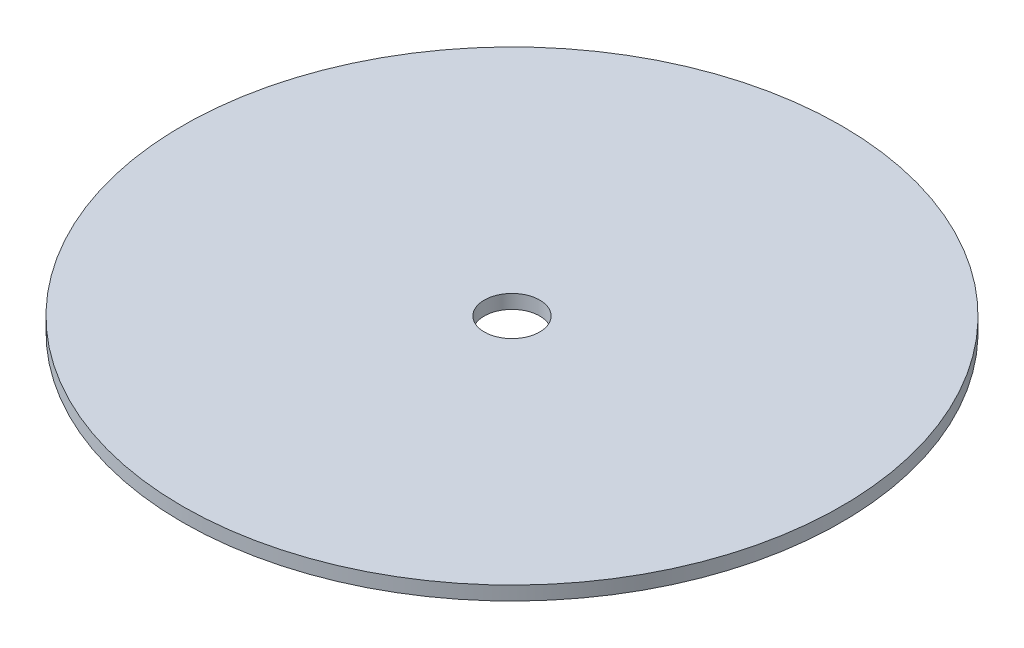
ISO-10303-21;
HEADER;
FILE_DESCRIPTION(('STEP AP214'),'2;1');
FILE_NAME('part.step','',(''),(''),'','','');
FILE_SCHEMA(('AUTOMOTIVE_DESIGN { 1 0 10303 214 1 1 1 1 }'));
ENDSEC;
DATA;
#1=APPLICATION_CONTEXT('core data for automotive mechanical design processes');
#2=APPLICATION_PROTOCOL_DEFINITION('international standard','automotive_design',2000,#1);
#3=PRODUCT_CONTEXT('',#1,'mechanical');
#4=PRODUCT('Part','Part','',(#3));
#5=PRODUCT_RELATED_PRODUCT_CATEGORY('part','',(#4));
#6=PRODUCT_DEFINITION_FORMATION('','',#4);
#7=PRODUCT_DEFINITION_CONTEXT('part definition',#1,'design');
#8=PRODUCT_DEFINITION('design','',#6,#7);
#9=PRODUCT_DEFINITION_SHAPE('','',#8);
#10=(LENGTH_UNIT() NAMED_UNIT(*) SI_UNIT(.MILLI.,.METRE.));
#11=(NAMED_UNIT(*) PLANE_ANGLE_UNIT() SI_UNIT($,.RADIAN.));
#12=(NAMED_UNIT(*) SI_UNIT($,.STERADIAN.) SOLID_ANGLE_UNIT());
#13=UNCERTAINTY_MEASURE_WITH_UNIT(LENGTH_MEASURE(1.E-05),#10,'distance_accuracy_value','');
#14=(GEOMETRIC_REPRESENTATION_CONTEXT(3) GLOBAL_UNCERTAINTY_ASSIGNED_CONTEXT((#13)) GLOBAL_UNIT_ASSIGNED_CONTEXT((#10,
#11,#12)) REPRESENTATION_CONTEXT('',''));
#15=CARTESIAN_POINT('',(0.,0.,0.));
#16=DIRECTION('',(0.,0.,1.));
#17=DIRECTION('',(1.,0.,0.));
#18=AXIS2_PLACEMENT_3D('',#15,#16,#17);
#19=CARTESIAN_POINT('',(0.,3.175,0.));
#20=DIRECTION('',(0.,-1.,0.));
#21=DIRECTION('',(0.,0.,-1.));
#22=AXIS2_PLACEMENT_3D('',#19,#20,#21);
#23=CYLINDRICAL_SURFACE('',#22,75.565);
#24=CARTESIAN_POINT('',(0.,3.175,0.));
#25=DIRECTION('',(0.,1.,0.));
#26=DIRECTION('',(0.,0.,1.));
#27=AXIS2_PLACEMENT_3D('',#24,#25,#26);
#28=CIRCLE('',#27,75.565);
#29=CARTESIAN_POINT('',(0.,3.175,75.565));
#30=VERTEX_POINT('',#29);
#31=EDGE_CURVE('E10',#30,#30,#28,.T.);
#32=ORIENTED_EDGE('',*,*,#31,.F.);
#33=EDGE_LOOP('',(#32));
#34=FACE_BOUND('',#33,.T.);
#35=CARTESIAN_POINT('',(0.,0.,0.));
#36=DIRECTION('',(0.,1.,0.));
#37=DIRECTION('',(0.,0.,1.));
#38=AXIS2_PLACEMENT_3D('',#35,#36,#37);
#39=CIRCLE('',#38,75.565);
#40=CARTESIAN_POINT('',(0.,0.,75.565));
#41=VERTEX_POINT('',#40);
#42=EDGE_CURVE('E34',#41,#41,#39,.T.);
#43=ORIENTED_EDGE('',*,*,#42,.T.);
#44=EDGE_LOOP('',(#43));
#45=FACE_BOUND('',#44,.T.);
#46=ADVANCED_FACE('F31',(#34,#45),#23,.T.);
#47=CARTESIAN_POINT('',(0.,3.175,0.));
#48=DIRECTION('',(0.,1.,0.));
#49=DIRECTION('',(0.,0.,1.));
#50=AXIS2_PLACEMENT_3D('',#47,#48,#49);
#51=PLANE('',#50);
#52=CARTESIAN_POINT('',(0.,3.175,0.));
#53=DIRECTION('',(0.,1.,0.));
#54=DIRECTION('',(0.,0.,1.));
#55=AXIS2_PLACEMENT_3D('',#52,#53,#54);
#56=CIRCLE('',#55,6.35);
#57=CARTESIAN_POINT('',(0.,3.175,6.35));
#58=VERTEX_POINT('',#57);
#59=EDGE_CURVE('E41',#58,#58,#56,.T.);
#60=ORIENTED_EDGE('',*,*,#59,.F.);
#61=EDGE_LOOP('',(#60));
#62=FACE_BOUND('',#61,.T.);
#63=ORIENTED_EDGE('',*,*,#31,.T.);
#64=EDGE_LOOP('',(#63));
#65=FACE_BOUND('',#64,.T.);
#66=ADVANCED_FACE('F59',(#62,#65),#51,.T.);
#67=CARTESIAN_POINT('',(0.,0.,0.));
#68=DIRECTION('',(0.,1.,0.));
#69=DIRECTION('',(0.,0.,1.));
#70=AXIS2_PLACEMENT_3D('',#67,#68,#69);
#71=PLANE('',#70);
#72=CARTESIAN_POINT('',(0.,0.,0.));
#73=DIRECTION('',(0.,1.,0.));
#74=DIRECTION('',(0.,0.,1.));
#75=AXIS2_PLACEMENT_3D('',#72,#73,#74);
#76=CIRCLE('',#75,6.35);
#77=CARTESIAN_POINT('',(0.,0.,6.35));
#78=VERTEX_POINT('',#77);
#79=EDGE_CURVE('E45',#78,#78,#76,.T.);
#80=ORIENTED_EDGE('',*,*,#79,.T.);
#81=EDGE_LOOP('',(#80));
#82=FACE_BOUND('',#81,.T.);
#83=ORIENTED_EDGE('',*,*,#42,.F.);
#84=EDGE_LOOP('',(#83));
#85=FACE_BOUND('',#84,.T.);
#86=ADVANCED_FACE('F49',(#82,#85),#71,.F.);
#87=CARTESIAN_POINT('',(0.,0.,0.));
#88=DIRECTION('',(0.,1.,0.));
#89=DIRECTION('',(0.,0.,1.));
#90=AXIS2_PLACEMENT_3D('',#87,#88,#89);
#91=CYLINDRICAL_SURFACE('',#90,6.35);
#92=ORIENTED_EDGE('',*,*,#59,.T.);
#93=EDGE_LOOP('',(#92));
#94=FACE_BOUND('',#93,.T.);
#95=ORIENTED_EDGE('',*,*,#79,.F.);
#96=EDGE_LOOP('',(#95));
#97=FACE_BOUND('',#96,.T.);
#98=ADVANCED_FACE('F52',(#94,#97),#91,.F.);
#99=CLOSED_SHELL('',(#46,#66,#86,#98));
#100=MANIFOLD_SOLID_BREP('B2',#99);
#101=ADVANCED_BREP_SHAPE_REPRESENTATION('',(#18,#100),#14);
#102=SHAPE_DEFINITION_REPRESENTATION(#9,#101);
ENDSEC;
END-ISO-10303-21;
